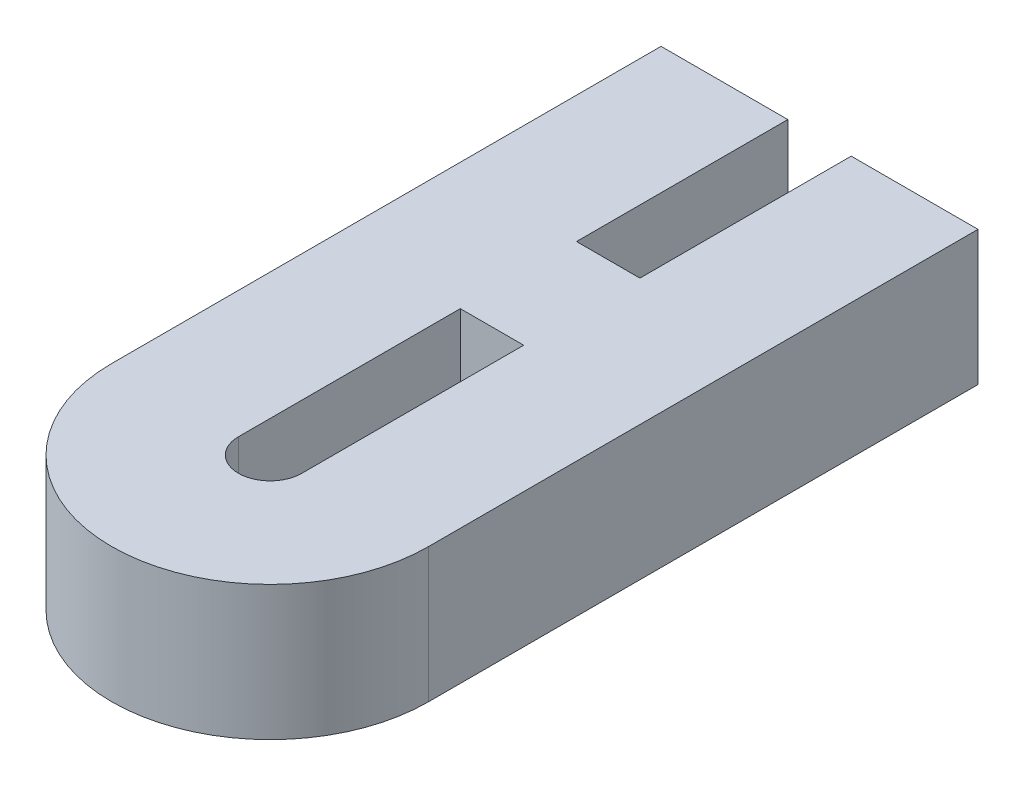
ISO-10303-21;
HEADER;
FILE_DESCRIPTION(('STEP AP214'),'2;1');
FILE_NAME('part.step','',(''),(''),'','','');
FILE_SCHEMA(('AUTOMOTIVE_DESIGN { 1 0 10303 214 1 1 1 1 }'));
ENDSEC;
DATA;
#1=APPLICATION_CONTEXT('core data for automotive mechanical design processes');
#2=APPLICATION_PROTOCOL_DEFINITION('international standard','automotive_design',2000,#1);
#3=PRODUCT_CONTEXT('',#1,'mechanical');
#4=PRODUCT('Part','Part','',(#3));
#5=PRODUCT_RELATED_PRODUCT_CATEGORY('part','',(#4));
#6=PRODUCT_DEFINITION_FORMATION('','',#4);
#7=PRODUCT_DEFINITION_CONTEXT('part definition',#1,'design');
#8=PRODUCT_DEFINITION('design','',#6,#7);
#9=PRODUCT_DEFINITION_SHAPE('','',#8);
#10=(LENGTH_UNIT() NAMED_UNIT(*) SI_UNIT(.MILLI.,.METRE.));
#11=(NAMED_UNIT(*) PLANE_ANGLE_UNIT() SI_UNIT($,.RADIAN.));
#12=(NAMED_UNIT(*) SI_UNIT($,.STERADIAN.) SOLID_ANGLE_UNIT());
#13=UNCERTAINTY_MEASURE_WITH_UNIT(LENGTH_MEASURE(1.E-05),#10,'distance_accuracy_value','');
#14=(GEOMETRIC_REPRESENTATION_CONTEXT(3) GLOBAL_UNCERTAINTY_ASSIGNED_CONTEXT((#13)) GLOBAL_UNIT_ASSIGNED_CONTEXT((#10,
#11,#12)) REPRESENTATION_CONTEXT('',''));
#15=CARTESIAN_POINT('',(0.,0.,0.));
#16=DIRECTION('',(0.,0.,1.));
#17=DIRECTION('',(1.,0.,0.));
#18=AXIS2_PLACEMENT_3D('',#15,#16,#17);
#19=CARTESIAN_POINT('',(900.153091895485,-71.,1310.4715054911));
#20=DIRECTION('',(-1.,0.,0.));
#21=DIRECTION('',(0.,0.,1.));
#22=AXIS2_PLACEMENT_3D('',#19,#20,#21);
#23=PLANE('',#22);
#24=DIRECTION('',(0.,0.,-1.));
#25=VECTOR('',#24,1.);
#26=CARTESIAN_POINT('',(900.153091895485,-79.,1310.4715054911));
#27=LINE('',#26,#25);
#28=CARTESIAN_POINT('',(900.153091895485,-79.,1310.4715054911));
#29=VERTEX_POINT('',#28);
#30=CARTESIAN_POINT('',(900.153091895485,-79.,1297.8980276768));
#31=VERTEX_POINT('',#30);
#32=EDGE_CURVE('E126',#29,#31,#27,.T.);
#33=ORIENTED_EDGE('',*,*,#32,.F.);
#34=DIRECTION('',(0.,-1.,0.));
#35=VECTOR('',#34,1.);
#36=CARTESIAN_POINT('',(900.153091895485,-71.,1310.4715054911));
#37=LINE('',#36,#35);
#38=CARTESIAN_POINT('',(900.153091895485,-71.,1310.4715054911));
#39=VERTEX_POINT('',#38);
#40=EDGE_CURVE('E186',#39,#29,#37,.T.);
#41=ORIENTED_EDGE('',*,*,#40,.F.);
#42=DIRECTION('',(0.,0.,-1.));
#43=VECTOR('',#42,1.);
#44=CARTESIAN_POINT('',(900.153091895485,-71.,1310.4715054911));
#45=LINE('',#44,#43);
#46=CARTESIAN_POINT('',(900.153091895485,-71.,1297.8980276768));
#47=VERTEX_POINT('',#46);
#48=EDGE_CURVE('E152',#39,#47,#45,.T.);
#49=ORIENTED_EDGE('',*,*,#48,.T.);
#50=DIRECTION('',(0.,-1.,0.));
#51=VECTOR('',#50,1.);
#52=CARTESIAN_POINT('',(900.153091895485,-71.,1297.8980276768));
#53=LINE('',#52,#51);
#54=EDGE_CURVE('E11',#47,#31,#53,.T.);
#55=ORIENTED_EDGE('',*,*,#54,.T.);
#56=EDGE_LOOP('',(#33,#41,#49,#55));
#57=FACE_BOUND('',#56,.T.);
#58=ADVANCED_FACE('F16',(#57),#23,.T.);
#59=CARTESIAN_POINT('',(907.697178584064,-71.,1297.8980276768));
#60=DIRECTION('',(0.,0.,1.));
#61=DIRECTION('',(1.,0.,0.));
#62=AXIS2_PLACEMENT_3D('',#59,#60,#61);
#63=PLANE('',#62);
#64=DIRECTION('',(-1.,0.,0.));
#65=VECTOR('',#64,1.);
#66=CARTESIAN_POINT('',(907.697178584064,-79.,1297.8980276768));
#67=LINE('',#66,#65);
#68=CARTESIAN_POINT('',(907.697178584064,-79.,1297.8980276768));
#69=VERTEX_POINT('',#68);
#70=EDGE_CURVE('E107',#69,#31,#67,.T.);
#71=ORIENTED_EDGE('',*,*,#70,.T.);
#72=ORIENTED_EDGE('',*,*,#54,.F.);
#73=DIRECTION('',(-1.,0.,0.));
#74=VECTOR('',#73,1.);
#75=CARTESIAN_POINT('',(907.697178584064,-71.,1297.8980276768));
#76=LINE('',#75,#74);
#77=CARTESIAN_POINT('',(907.697178584064,-71.,1297.8980276768));
#78=VERTEX_POINT('',#77);
#79=EDGE_CURVE('E110',#78,#47,#76,.T.);
#80=ORIENTED_EDGE('',*,*,#79,.F.);
#81=DIRECTION('',(0.,-1.,0.));
#82=VECTOR('',#81,1.);
#83=CARTESIAN_POINT('',(907.697178584064,-71.,1297.8980276768));
#84=LINE('',#83,#82);
#85=EDGE_CURVE('E19',#78,#69,#84,.T.);
#86=ORIENTED_EDGE('',*,*,#85,.T.);
#87=EDGE_LOOP('',(#71,#72,#80,#86));
#88=FACE_BOUND('',#87,.T.);
#89=ADVANCED_FACE('F105',(#88),#63,.F.);
#90=CARTESIAN_POINT('',(907.697178584064,-71.,1330.58906999398));
#91=DIRECTION('',(-1.,0.,0.));
#92=DIRECTION('',(0.,0.,1.));
#93=AXIS2_PLACEMENT_3D('',#90,#91,#92);
#94=PLANE('',#93);
#95=DIRECTION('',(0.,0.,-1.));
#96=VECTOR('',#95,1.);
#97=CARTESIAN_POINT('',(907.697178584064,-79.,1330.58906999398));
#98=LINE('',#97,#96);
#99=CARTESIAN_POINT('',(907.697178584064,-79.,1330.58906999398));
#100=VERTEX_POINT('',#99);
#101=EDGE_CURVE('E116',#100,#69,#98,.T.);
#102=ORIENTED_EDGE('',*,*,#101,.T.);
#103=ORIENTED_EDGE('',*,*,#85,.F.);
#104=DIRECTION('',(0.,0.,-1.));
#105=VECTOR('',#104,1.);
#106=CARTESIAN_POINT('',(907.697178584064,-71.,1330.58906999398));
#107=LINE('',#106,#105);
#108=CARTESIAN_POINT('',(907.697178584064,-71.,1330.58906999398));
#109=VERTEX_POINT('',#108);
#110=EDGE_CURVE('E154',#109,#78,#107,.T.);
#111=ORIENTED_EDGE('',*,*,#110,.F.);
#112=DIRECTION('',(0.,-1.,0.));
#113=VECTOR('',#112,1.);
#114=CARTESIAN_POINT('',(907.697178584064,-71.,1330.58906999398));
#115=LINE('',#114,#113);
#116=EDGE_CURVE('E114',#109,#100,#115,.T.);
#117=ORIENTED_EDGE('',*,*,#116,.T.);
#118=EDGE_LOOP('',(#102,#103,#111,#117));
#119=FACE_BOUND('',#118,.T.);
#120=ADVANCED_FACE('F117',(#119),#94,.F.);
#121=CARTESIAN_POINT('',(898.26707022334,-71.,1330.58906999398));
#122=DIRECTION('',(0.,-1.,0.));
#123=DIRECTION('',(0.,0.,-1.));
#124=AXIS2_PLACEMENT_3D('',#121,#122,#123);
#125=CYLINDRICAL_SURFACE('',#124,9.43010836072444);
#126=CARTESIAN_POINT('',(898.26707022334,-79.,1330.58906999398));
#127=DIRECTION('',(0.,-1.,0.));
#128=DIRECTION('',(-1.,0.,0.));
#129=AXIS2_PLACEMENT_3D('',#126,#127,#128);
#130=CIRCLE('',#129,9.43010836072444);
#131=CARTESIAN_POINT('',(888.836961862615,-79.,1330.58906999398));
#132=VERTEX_POINT('',#131);
#133=EDGE_CURVE('E121',#100,#132,#130,.T.);
#134=ORIENTED_EDGE('',*,*,#133,.F.);
#135=ORIENTED_EDGE('',*,*,#116,.F.);
#136=CARTESIAN_POINT('',(898.26707022334,-71.,1330.58906999398));
#137=DIRECTION('',(0.,-1.,0.));
#138=DIRECTION('',(-1.,0.,0.));
#139=AXIS2_PLACEMENT_3D('',#136,#137,#138);
#140=CIRCLE('',#139,9.43010836072444);
#141=CARTESIAN_POINT('',(888.836961862615,-71.,1330.58906999398));
#142=VERTEX_POINT('',#141);
#143=EDGE_CURVE('E156',#109,#142,#140,.T.);
#144=ORIENTED_EDGE('',*,*,#143,.T.);
#145=DIRECTION('',(0.,-1.,0.));
#146=VECTOR('',#145,1.);
#147=CARTESIAN_POINT('',(888.836961862615,-71.,1330.58906999398));
#148=LINE('',#147,#146);
#149=EDGE_CURVE('E198',#142,#132,#148,.T.);
#150=ORIENTED_EDGE('',*,*,#149,.T.);
#151=EDGE_LOOP('',(#134,#135,#144,#150));
#152=FACE_BOUND('',#151,.T.);
#153=ADVANCED_FACE('F202',(#152),#125,.T.);
#154=CARTESIAN_POINT('',(888.836961862615,-71.,1330.58906999398));
#155=DIRECTION('',(-1.,0.,0.));
#156=DIRECTION('',(0.,0.,1.));
#157=AXIS2_PLACEMENT_3D('',#154,#155,#156);
#158=PLANE('',#157);
#159=DIRECTION('',(0.,0.,-1.));
#160=VECTOR('',#159,1.);
#161=CARTESIAN_POINT('',(888.836961862615,-79.,1330.58906999398));
#162=LINE('',#161,#160);
#163=CARTESIAN_POINT('',(888.836961862615,-79.,1297.8980276768));
#164=VERTEX_POINT('',#163);
#165=EDGE_CURVE('E131',#132,#164,#162,.T.);
#166=ORIENTED_EDGE('',*,*,#165,.F.);
#167=ORIENTED_EDGE('',*,*,#149,.F.);
#168=DIRECTION('',(0.,0.,-1.));
#169=VECTOR('',#168,1.);
#170=CARTESIAN_POINT('',(888.836961862615,-71.,1330.58906999398));
#171=LINE('',#170,#169);
#172=CARTESIAN_POINT('',(888.836961862615,-71.,1297.8980276768));
#173=VERTEX_POINT('',#172);
#174=EDGE_CURVE('E159',#142,#173,#171,.T.);
#175=ORIENTED_EDGE('',*,*,#174,.T.);
#176=DIRECTION('',(0.,-1.,0.));
#177=VECTOR('',#176,1.);
#178=CARTESIAN_POINT('',(888.836961862615,-71.,1297.8980276768));
#179=LINE('',#178,#177);
#180=EDGE_CURVE('E196',#173,#164,#179,.T.);
#181=ORIENTED_EDGE('',*,*,#180,.T.);
#182=EDGE_LOOP('',(#166,#167,#175,#181));
#183=FACE_BOUND('',#182,.T.);
#184=ADVANCED_FACE('F206',(#183),#158,.T.);
#185=CARTESIAN_POINT('',(896.381048551195,-71.,1297.8980276768));
#186=DIRECTION('',(0.,0.,1.));
#187=DIRECTION('',(1.,0.,0.));
#188=AXIS2_PLACEMENT_3D('',#185,#186,#187);
#189=PLANE('',#188);
#190=DIRECTION('',(-1.,0.,0.));
#191=VECTOR('',#190,1.);
#192=CARTESIAN_POINT('',(896.381048551195,-79.,1297.8980276768));
#193=LINE('',#192,#191);
#194=CARTESIAN_POINT('',(896.381048551195,-79.,1297.8980276768));
#195=VERTEX_POINT('',#194);
#196=EDGE_CURVE('E134',#195,#164,#193,.T.);
#197=ORIENTED_EDGE('',*,*,#196,.T.);
#198=ORIENTED_EDGE('',*,*,#180,.F.);
#199=DIRECTION('',(-1.,0.,0.));
#200=VECTOR('',#199,1.);
#201=CARTESIAN_POINT('',(896.381048551195,-71.,1297.8980276768));
#202=LINE('',#201,#200);
#203=CARTESIAN_POINT('',(896.381048551195,-71.,1297.8980276768));
#204=VERTEX_POINT('',#203);
#205=EDGE_CURVE('E162',#204,#173,#202,.T.);
#206=ORIENTED_EDGE('',*,*,#205,.F.);
#207=DIRECTION('',(0.,-1.,0.));
#208=VECTOR('',#207,1.);
#209=CARTESIAN_POINT('',(896.381048551195,-71.,1297.8980276768));
#210=LINE('',#209,#208);
#211=EDGE_CURVE('E194',#204,#195,#210,.T.);
#212=ORIENTED_EDGE('',*,*,#211,.T.);
#213=EDGE_LOOP('',(#197,#198,#206,#212));
#214=FACE_BOUND('',#213,.T.);
#215=ADVANCED_FACE('F210',(#214),#189,.F.);
#216=CARTESIAN_POINT('',(896.381048551195,-71.,1310.4715054911));
#217=DIRECTION('',(-1.,0.,0.));
#218=DIRECTION('',(0.,0.,1.));
#219=AXIS2_PLACEMENT_3D('',#216,#217,#218);
#220=PLANE('',#219);
#221=DIRECTION('',(0.,0.,-1.));
#222=VECTOR('',#221,1.);
#223=CARTESIAN_POINT('',(896.381048551195,-79.,1310.4715054911));
#224=LINE('',#223,#222);
#225=CARTESIAN_POINT('',(896.381048551195,-79.,1310.4715054911));
#226=VERTEX_POINT('',#225);
#227=EDGE_CURVE('E137',#226,#195,#224,.T.);
#228=ORIENTED_EDGE('',*,*,#227,.T.);
#229=ORIENTED_EDGE('',*,*,#211,.F.);
#230=DIRECTION('',(0.,0.,-1.));
#231=VECTOR('',#230,1.);
#232=CARTESIAN_POINT('',(896.381048551195,-71.,1310.4715054911));
#233=LINE('',#232,#231);
#234=CARTESIAN_POINT('',(896.381048551195,-71.,1310.4715054911));
#235=VERTEX_POINT('',#234);
#236=EDGE_CURVE('E165',#235,#204,#233,.T.);
#237=ORIENTED_EDGE('',*,*,#236,.F.);
#238=DIRECTION('',(0.,-1.,0.));
#239=VECTOR('',#238,1.);
#240=CARTESIAN_POINT('',(896.381048551195,-71.,1310.4715054911));
#241=LINE('',#240,#239);
#242=EDGE_CURVE('E192',#235,#226,#241,.T.);
#243=ORIENTED_EDGE('',*,*,#242,.T.);
#244=EDGE_LOOP('',(#228,#229,#237,#243));
#245=FACE_BOUND('',#244,.T.);
#246=ADVANCED_FACE('F214',(#245),#220,.F.);
#247=CARTESIAN_POINT('',(896.381048551195,-71.,1317.38691828896));
#248=DIRECTION('',(0.,0.,-1.));
#249=DIRECTION('',(-1.,0.,0.));
#250=AXIS2_PLACEMENT_3D('',#247,#248,#249);
#251=PLANE('',#250);
#252=DIRECTION('',(1.,0.,0.));
#253=VECTOR('',#252,1.);
#254=CARTESIAN_POINT('',(896.381048551195,-79.,1317.38691828896));
#255=LINE('',#254,#253);
#256=CARTESIAN_POINT('',(896.381048551195,-79.,1317.38691828896));
#257=VERTEX_POINT('',#256);
#258=CARTESIAN_POINT('',(900.153091895485,-79.,1317.38691828896));
#259=VERTEX_POINT('',#258);
#260=EDGE_CURVE('E149',#257,#259,#255,.T.);
#261=ORIENTED_EDGE('',*,*,#260,.T.);
#262=DIRECTION('',(0.,-1.,0.));
#263=VECTOR('',#262,1.);
#264=CARTESIAN_POINT('',(900.153091895485,-71.,1317.38691828896));
#265=LINE('',#264,#263);
#266=CARTESIAN_POINT('',(900.153091895485,-71.,1317.38691828896));
#267=VERTEX_POINT('',#266);
#268=EDGE_CURVE('E184',#267,#259,#265,.T.);
#269=ORIENTED_EDGE('',*,*,#268,.F.);
#270=DIRECTION('',(1.,0.,0.));
#271=VECTOR('',#270,1.);
#272=CARTESIAN_POINT('',(896.381048551195,-71.,1317.38691828896));
#273=LINE('',#272,#271);
#274=CARTESIAN_POINT('',(896.381048551195,-71.,1317.38691828896));
#275=VERTEX_POINT('',#274);
#276=EDGE_CURVE('E181',#275,#267,#273,.T.);
#277=ORIENTED_EDGE('',*,*,#276,.F.);
#278=DIRECTION('',(0.,-1.,0.));
#279=VECTOR('',#278,1.);
#280=CARTESIAN_POINT('',(896.381048551195,-71.,1317.38691828896));
#281=LINE('',#280,#279);
#282=EDGE_CURVE('E30',#275,#257,#281,.T.);
#283=ORIENTED_EDGE('',*,*,#282,.T.);
#284=EDGE_LOOP('',(#261,#269,#277,#283));
#285=FACE_BOUND('',#284,.T.);
#286=ADVANCED_FACE('F252',(#285),#251,.F.);
#287=CARTESIAN_POINT('',(896.381048551195,-71.,1330.58906999398));
#288=DIRECTION('',(-1.,0.,0.));
#289=DIRECTION('',(0.,0.,1.));
#290=AXIS2_PLACEMENT_3D('',#287,#288,#289);
#291=PLANE('',#290);
#292=DIRECTION('',(0.,0.,-1.));
#293=VECTOR('',#292,1.);
#294=CARTESIAN_POINT('',(896.381048551195,-79.,1330.58906999398));
#295=LINE('',#294,#293);
#296=CARTESIAN_POINT('',(896.381048551195,-79.,1330.58906999398));
#297=VERTEX_POINT('',#296);
#298=EDGE_CURVE('E147',#297,#257,#295,.T.);
#299=ORIENTED_EDGE('',*,*,#298,.T.);
#300=ORIENTED_EDGE('',*,*,#282,.F.);
#301=DIRECTION('',(0.,0.,-1.));
#302=VECTOR('',#301,1.);
#303=CARTESIAN_POINT('',(896.381048551195,-71.,1330.58906999398));
#304=LINE('',#303,#302);
#305=CARTESIAN_POINT('',(896.381048551195,-71.,1330.58906999398));
#306=VERTEX_POINT('',#305);
#307=EDGE_CURVE('E179',#306,#275,#304,.T.);
#308=ORIENTED_EDGE('',*,*,#307,.F.);
#309=DIRECTION('',(0.,-1.,0.));
#310=VECTOR('',#309,1.);
#311=CARTESIAN_POINT('',(896.381048551195,-71.,1330.58906999398));
#312=LINE('',#311,#310);
#313=EDGE_CURVE('E38',#306,#297,#312,.T.);
#314=ORIENTED_EDGE('',*,*,#313,.T.);
#315=EDGE_LOOP('',(#299,#300,#308,#314));
#316=FACE_BOUND('',#315,.T.);
#317=ADVANCED_FACE('F260',(#316),#291,.F.);
#318=CARTESIAN_POINT('',(898.26707022334,-71.,1330.58906999398));
#319=DIRECTION('',(0.,-1.,0.));
#320=DIRECTION('',(0.,0.,-1.));
#321=AXIS2_PLACEMENT_3D('',#318,#319,#320);
#322=CYLINDRICAL_SURFACE('',#321,1.88602167214489);
#323=CARTESIAN_POINT('',(898.26707022334,-79.,1330.58906999398));
#324=DIRECTION('',(0.,-1.,0.));
#325=DIRECTION('',(-1.,0.,0.));
#326=AXIS2_PLACEMENT_3D('',#323,#324,#325);
#327=CIRCLE('',#326,1.88602167214489);
#328=CARTESIAN_POINT('',(900.153091895485,-79.,1330.58906999398));
#329=VERTEX_POINT('',#328);
#330=EDGE_CURVE('E145',#329,#297,#327,.T.);
#331=ORIENTED_EDGE('',*,*,#330,.T.);
#332=ORIENTED_EDGE('',*,*,#313,.F.);
#333=CARTESIAN_POINT('',(898.26707022334,-71.,1330.58906999398));
#334=DIRECTION('',(0.,-1.,0.));
#335=DIRECTION('',(-1.,0.,0.));
#336=AXIS2_PLACEMENT_3D('',#333,#334,#335);
#337=CIRCLE('',#336,1.88602167214489);
#338=CARTESIAN_POINT('',(900.153091895485,-71.,1330.58906999398));
#339=VERTEX_POINT('',#338);
#340=EDGE_CURVE('E176',#339,#306,#337,.T.);
#341=ORIENTED_EDGE('',*,*,#340,.F.);
#342=DIRECTION('',(0.,-1.,0.));
#343=VECTOR('',#342,1.);
#344=CARTESIAN_POINT('',(900.153091895485,-71.,1330.58906999398));
#345=LINE('',#344,#343);
#346=EDGE_CURVE('E188',#339,#329,#345,.T.);
#347=ORIENTED_EDGE('',*,*,#346,.T.);
#348=EDGE_LOOP('',(#331,#332,#341,#347));
#349=FACE_BOUND('',#348,.T.);
#350=ADVANCED_FACE('F256',(#349),#322,.F.);
#351=CARTESIAN_POINT('',(900.153091895485,-71.,1330.58906999398));
#352=DIRECTION('',(-1.,0.,0.));
#353=DIRECTION('',(0.,0.,1.));
#354=AXIS2_PLACEMENT_3D('',#351,#352,#353);
#355=PLANE('',#354);
#356=DIRECTION('',(0.,0.,-1.));
#357=VECTOR('',#356,1.);
#358=CARTESIAN_POINT('',(900.153091895485,-79.,1330.58906999398));
#359=LINE('',#358,#357);
#360=EDGE_CURVE('E141',#329,#259,#359,.T.);
#361=ORIENTED_EDGE('',*,*,#360,.F.);
#362=ORIENTED_EDGE('',*,*,#346,.F.);
#363=DIRECTION('',(0.,0.,-1.));
#364=VECTOR('',#363,1.);
#365=CARTESIAN_POINT('',(900.153091895485,-71.,1330.58906999398));
#366=LINE('',#365,#364);
#367=EDGE_CURVE('E171',#339,#267,#366,.T.);
#368=ORIENTED_EDGE('',*,*,#367,.T.);
#369=ORIENTED_EDGE('',*,*,#268,.T.);
#370=EDGE_LOOP('',(#361,#362,#368,#369));
#371=FACE_BOUND('',#370,.T.);
#372=ADVANCED_FACE('F233',(#371),#355,.T.);
#373=CARTESIAN_POINT('',(896.381048551195,-71.,1310.4715054911));
#374=DIRECTION('',(0.,0.,-1.));
#375=DIRECTION('',(-1.,0.,0.));
#376=AXIS2_PLACEMENT_3D('',#373,#374,#375);
#377=PLANE('',#376);
#378=DIRECTION('',(1.,0.,0.));
#379=VECTOR('',#378,1.);
#380=CARTESIAN_POINT('',(896.381048551195,-79.,1310.4715054911));
#381=LINE('',#380,#379);
#382=EDGE_CURVE('E140',#226,#29,#381,.T.);
#383=ORIENTED_EDGE('',*,*,#382,.F.);
#384=ORIENTED_EDGE('',*,*,#242,.F.);
#385=DIRECTION('',(1.,0.,0.));
#386=VECTOR('',#385,1.);
#387=CARTESIAN_POINT('',(896.381048551195,-71.,1310.4715054911));
#388=LINE('',#387,#386);
#389=EDGE_CURVE('E168',#235,#39,#388,.T.);
#390=ORIENTED_EDGE('',*,*,#389,.T.);
#391=ORIENTED_EDGE('',*,*,#40,.T.);
#392=EDGE_LOOP('',(#383,#384,#390,#391));
#393=FACE_BOUND('',#392,.T.);
#394=ADVANCED_FACE('F218',(#393),#377,.T.);
#395=CARTESIAN_POINT('',(898.26707022334,-71.,1330.58906999398));
#396=DIRECTION('',(0.,-1.,0.));
#397=DIRECTION('',(0.,0.,-1.));
#398=AXIS2_PLACEMENT_3D('',#395,#396,#397);
#399=PLANE('',#398);
#400=ORIENTED_EDGE('',*,*,#276,.T.);
#401=ORIENTED_EDGE('',*,*,#367,.F.);
#402=ORIENTED_EDGE('',*,*,#340,.T.);
#403=ORIENTED_EDGE('',*,*,#307,.T.);
#404=EDGE_LOOP('',(#400,#401,#402,#403));
#405=FACE_BOUND('',#404,.T.);
#406=ORIENTED_EDGE('',*,*,#48,.F.);
#407=ORIENTED_EDGE('',*,*,#389,.F.);
#408=ORIENTED_EDGE('',*,*,#236,.T.);
#409=ORIENTED_EDGE('',*,*,#205,.T.);
#410=ORIENTED_EDGE('',*,*,#174,.F.);
#411=ORIENTED_EDGE('',*,*,#143,.F.);
#412=ORIENTED_EDGE('',*,*,#110,.T.);
#413=ORIENTED_EDGE('',*,*,#79,.T.);
#414=EDGE_LOOP('',(#406,#407,#408,#409,#410,#411,#412,#413));
#415=FACE_BOUND('',#414,.T.);
#416=ADVANCED_FACE('F222',(#405,#415),#399,.F.);
#417=CARTESIAN_POINT('',(898.26707022334,-79.,1330.58906999398));
#418=DIRECTION('',(0.,-1.,0.));
#419=DIRECTION('',(0.,0.,-1.));
#420=AXIS2_PLACEMENT_3D('',#417,#418,#419);
#421=PLANE('',#420);
#422=ORIENTED_EDGE('',*,*,#260,.F.);
#423=ORIENTED_EDGE('',*,*,#298,.F.);
#424=ORIENTED_EDGE('',*,*,#330,.F.);
#425=ORIENTED_EDGE('',*,*,#360,.T.);
#426=EDGE_LOOP('',(#422,#423,#424,#425));
#427=FACE_BOUND('',#426,.T.);
#428=ORIENTED_EDGE('',*,*,#32,.T.);
#429=ORIENTED_EDGE('',*,*,#70,.F.);
#430=ORIENTED_EDGE('',*,*,#101,.F.);
#431=ORIENTED_EDGE('',*,*,#133,.T.);
#432=ORIENTED_EDGE('',*,*,#165,.T.);
#433=ORIENTED_EDGE('',*,*,#196,.F.);
#434=ORIENTED_EDGE('',*,*,#227,.F.);
#435=ORIENTED_EDGE('',*,*,#382,.T.);
#436=EDGE_LOOP('',(#428,#429,#430,#431,#432,#433,#434,#435));
#437=FACE_BOUND('',#436,.T.);
#438=ADVANCED_FACE('F123',(#427,#437),#421,.T.);
#439=CLOSED_SHELL('',(#58,#89,#120,#153,#184,#215,#246,#286,#317,#350,#372,#394,#416,#438));
#440=MANIFOLD_SOLID_BREP('B1',#439);
#441=ADVANCED_BREP_SHAPE_REPRESENTATION('',(#18,#440),#14);
#442=SHAPE_DEFINITION_REPRESENTATION(#9,#441);
ENDSEC;
END-ISO-10303-21;
